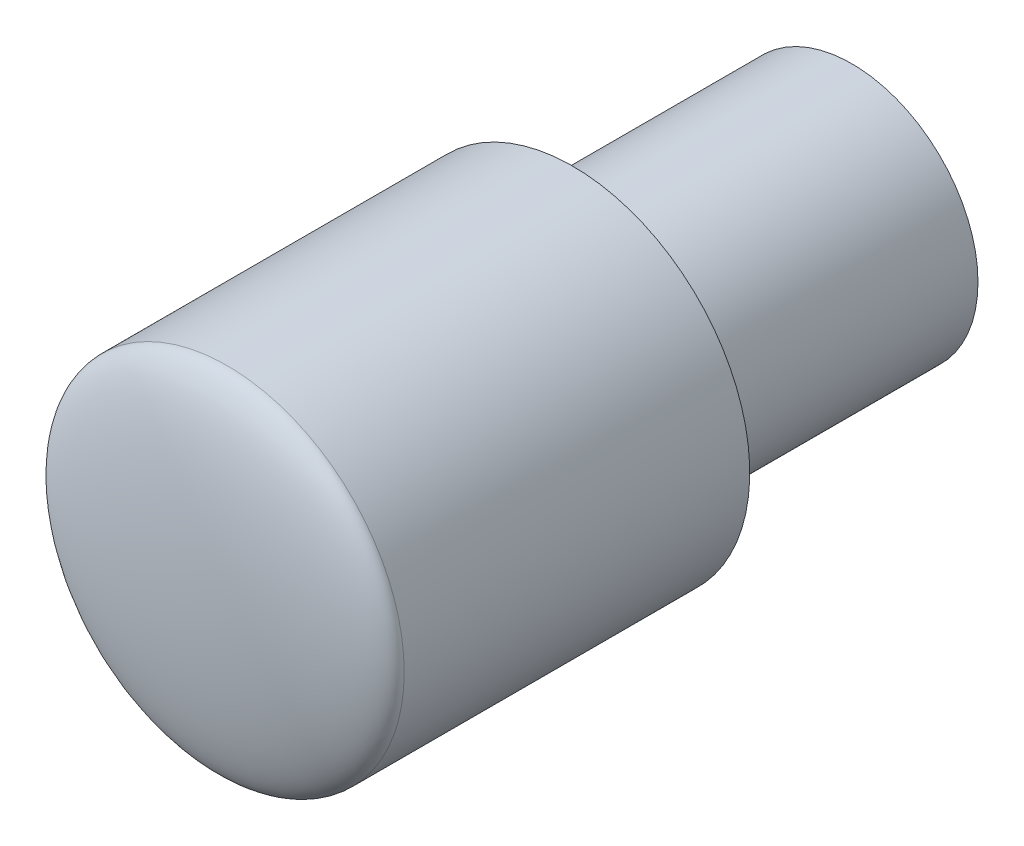
ISO-10303-21;
HEADER;
FILE_DESCRIPTION(('STEP AP214'),'2;1');
FILE_NAME('part.step','',(''),(''),'','','');
FILE_SCHEMA(('AUTOMOTIVE_DESIGN { 1 0 10303 214 1 1 1 1 }'));
ENDSEC;
DATA;
#1=APPLICATION_CONTEXT('core data for automotive mechanical design processes');
#2=APPLICATION_PROTOCOL_DEFINITION('international standard','automotive_design',2000,#1);
#3=PRODUCT_CONTEXT('',#1,'mechanical');
#4=PRODUCT('Part','Part','',(#3));
#5=PRODUCT_RELATED_PRODUCT_CATEGORY('part','',(#4));
#6=PRODUCT_DEFINITION_FORMATION('','',#4);
#7=PRODUCT_DEFINITION_CONTEXT('part definition',#1,'design');
#8=PRODUCT_DEFINITION('design','',#6,#7);
#9=PRODUCT_DEFINITION_SHAPE('','',#8);
#10=(LENGTH_UNIT() NAMED_UNIT(*) SI_UNIT(.MILLI.,.METRE.));
#11=(NAMED_UNIT(*) PLANE_ANGLE_UNIT() SI_UNIT($,.RADIAN.));
#12=(NAMED_UNIT(*) SI_UNIT($,.STERADIAN.) SOLID_ANGLE_UNIT());
#13=UNCERTAINTY_MEASURE_WITH_UNIT(LENGTH_MEASURE(1.E-05),#10,'distance_accuracy_value','');
#14=(GEOMETRIC_REPRESENTATION_CONTEXT(3) GLOBAL_UNCERTAINTY_ASSIGNED_CONTEXT((#13)) GLOBAL_UNIT_ASSIGNED_CONTEXT((#10,
#11,#12)) REPRESENTATION_CONTEXT('',''));
#15=CARTESIAN_POINT('',(0.,0.,0.));
#16=DIRECTION('',(0.,0.,1.));
#17=DIRECTION('',(1.,0.,0.));
#18=AXIS2_PLACEMENT_3D('',#15,#16,#17);
#19=CARTESIAN_POINT('',(-45.9250338285771,18.9480355186866,40.3601361619194));
#20=DIRECTION('',(0.,0.,-1.));
#21=DIRECTION('',(-1.,0.,0.));
#22=AXIS2_PLACEMENT_3D('',#19,#20,#21);
#23=CYLINDRICAL_SURFACE('',#22,11.4341305899212);
#24=CARTESIAN_POINT('',(-45.9250338285771,18.9480355186866,40.3601361619194));
#25=DIRECTION('',(0.,0.,1.));
#26=DIRECTION('',(1.,0.,0.));
#27=AXIS2_PLACEMENT_3D('',#24,#25,#26);
#28=CIRCLE('',#27,11.4341305899212);
#29=CARTESIAN_POINT('',(-34.4909032386559,18.9480355186866,40.3601361619194));
#30=VERTEX_POINT('',#29);
#31=EDGE_CURVE('E12',#30,#30,#28,.T.);
#32=ORIENTED_EDGE('',*,*,#31,.F.);
#33=EDGE_LOOP('',(#32));
#34=FACE_BOUND('',#33,.T.);
#35=CARTESIAN_POINT('',(-45.9250338285771,18.9480355186866,18.034));
#36=DIRECTION('',(0.,0.,-1.));
#37=DIRECTION('',(-1.,0.,0.));
#38=AXIS2_PLACEMENT_3D('',#35,#36,#37);
#39=CIRCLE('',#38,11.4341305899212);
#40=CARTESIAN_POINT('',(-57.3591644184983,18.9480355186866,18.034));
#41=VERTEX_POINT('',#40);
#42=EDGE_CURVE('E39',#41,#41,#39,.T.);
#43=ORIENTED_EDGE('',*,*,#42,.F.);
#44=EDGE_LOOP('',(#43));
#45=FACE_BOUND('',#44,.T.);
#46=ADVANCED_FACE('F34',(#34,#45),#23,.T.);
#47=CARTESIAN_POINT('',(-45.9250338285771,18.9480355186866,40.3601361619194));
#48=DIRECTION('',(0.,1.,0.));
#49=DIRECTION('',(1.,0.,0.));
#50=AXIS2_PLACEMENT_3D('',#47,#48,#49);
#51=ELLIPSE('',#50,11.4341305899212,2.54);
#52=TRIMMED_CURVE('',#51,(PARAMETER_VALUE(4.71238898038469)),
(PARAMETER_VALUE(7.85398163397448)),.T.,.PARAMETER.);
#53=CARTESIAN_POINT('',(-45.9250338285771,18.9480355186866,37.8201361619195));
#54=DIRECTION('',(0.,0.,1.));
#55=AXIS1_PLACEMENT('',#53,#54);
#56=SURFACE_OF_REVOLUTION('',#52,#55);
#57=CARTESIAN_POINT('',(-45.9250338285771,18.9480355186866,42.9001361619194));
#58=VERTEX_POINT('',#57);
#59=VERTEX_LOOP('',#58);
#60=FACE_BOUND('',#59,.T.);
#61=ORIENTED_EDGE('',*,*,#31,.T.);
#62=EDGE_LOOP('',(#61));
#63=FACE_BOUND('',#62,.T.);
#64=ADVANCED_FACE('F36',(#60,#63),#56,.F.);
#65=CARTESIAN_POINT('',(-45.9250338285771,18.9480355186866,18.034));
#66=DIRECTION('',(0.,0.,-1.));
#67=DIRECTION('',(-1.,0.,0.));
#68=AXIS2_PLACEMENT_3D('',#65,#66,#67);
#69=PLANE('',#68);
#70=CARTESIAN_POINT('',(-45.9250338285771,18.9480355186866,18.034));
#71=DIRECTION('',(0.,0.,-1.));
#72=DIRECTION('',(-1.,0.,0.));
#73=AXIS2_PLACEMENT_3D('',#70,#71,#72);
#74=CIRCLE('',#73,8.1494008602283);
#75=CARTESIAN_POINT('',(-54.0744346888054,18.9480355186866,18.034));
#76=VERTEX_POINT('',#75);
#77=EDGE_CURVE('E55',#76,#76,#74,.T.);
#78=ORIENTED_EDGE('',*,*,#77,.F.);
#79=EDGE_LOOP('',(#78));
#80=FACE_BOUND('',#79,.T.);
#81=ORIENTED_EDGE('',*,*,#42,.T.);
#82=EDGE_LOOP('',(#81));
#83=FACE_BOUND('',#82,.T.);
#84=ADVANCED_FACE('F47',(#80,#83),#69,.T.);
#85=CARTESIAN_POINT('',(-45.9250338285771,18.9480355186866,18.034));
#86=DIRECTION('',(0.,0.,-1.));
#87=DIRECTION('',(-1.,0.,0.));
#88=AXIS2_PLACEMENT_3D('',#85,#86,#87);
#89=CYLINDRICAL_SURFACE('',#88,8.1494008602283);
#90=ORIENTED_EDGE('',*,*,#77,.T.);
#91=EDGE_LOOP('',(#90));
#92=FACE_BOUND('',#91,.T.);
#93=CARTESIAN_POINT('',(-45.9250338285771,18.9480355186866,0.));
#94=DIRECTION('',(0.,0.,-1.));
#95=DIRECTION('',(-1.,0.,0.));
#96=AXIS2_PLACEMENT_3D('',#93,#94,#95);
#97=CIRCLE('',#96,8.1494008602283);
#98=CARTESIAN_POINT('',(-54.0744346888054,18.9480355186866,0.));
#99=VERTEX_POINT('',#98);
#100=EDGE_CURVE('E57',#99,#99,#97,.T.);
#101=ORIENTED_EDGE('',*,*,#100,.F.);
#102=EDGE_LOOP('',(#101));
#103=FACE_BOUND('',#102,.T.);
#104=ADVANCED_FACE('F68',(#92,#103),#89,.T.);
#105=CARTESIAN_POINT('',(-45.9250338285771,18.9480355186866,0.));
#106=DIRECTION('',(0.,0.,1.));
#107=DIRECTION('',(1.,0.,0.));
#108=AXIS2_PLACEMENT_3D('',#105,#106,#107);
#109=PLANE('',#108);
#110=ORIENTED_EDGE('',*,*,#100,.T.);
#111=EDGE_LOOP('',(#110));
#112=FACE_BOUND('',#111,.T.);
#113=ADVANCED_FACE('F66',(#112),#109,.F.);
#114=CLOSED_SHELL('',(#46,#64,#84,#104,#113));
#115=MANIFOLD_SOLID_BREP('B2',#114);
#116=ADVANCED_BREP_SHAPE_REPRESENTATION('',(#18,#115),#14);
#117=SHAPE_DEFINITION_REPRESENTATION(#9,#116);
ENDSEC;
END-ISO-10303-21;
